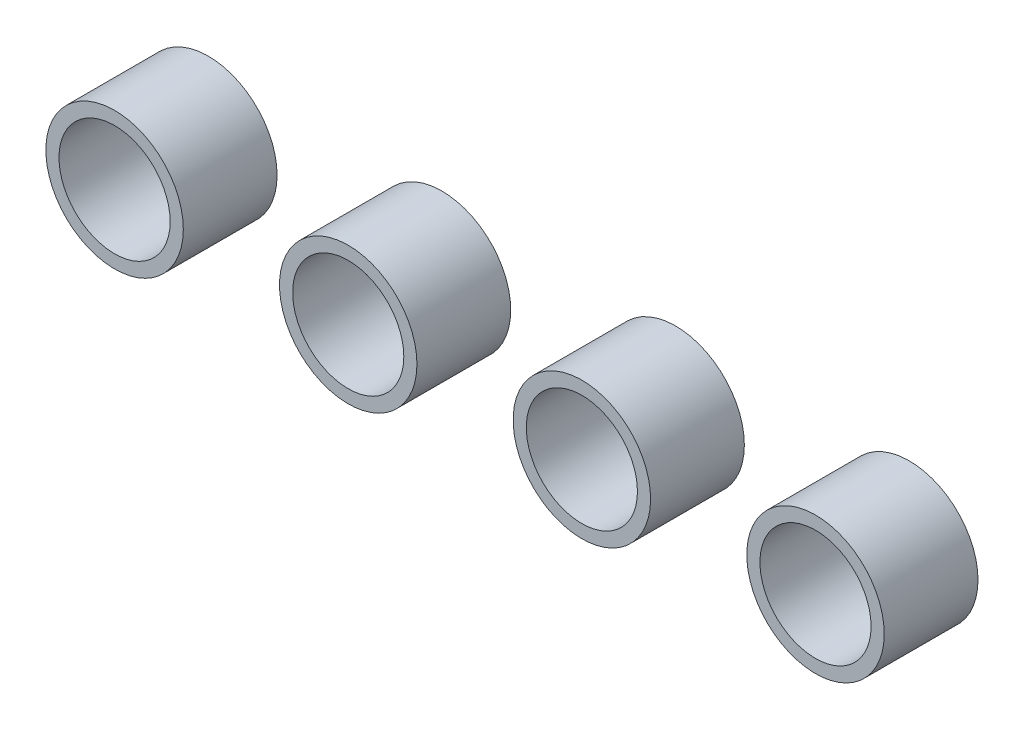
ISO-10303-21;
HEADER;
FILE_DESCRIPTION(('STEP AP214'),'2;1');
FILE_NAME('part.step','',(''),(''),'','','');
FILE_SCHEMA(('AUTOMOTIVE_DESIGN { 1 0 10303 214 1 1 1 1 }'));
ENDSEC;
DATA;
#1=APPLICATION_CONTEXT('core data for automotive mechanical design processes');
#2=APPLICATION_PROTOCOL_DEFINITION('international standard','automotive_design',2000,#1);
#3=PRODUCT_CONTEXT('',#1,'mechanical');
#4=PRODUCT('Part','Part','',(#3));
#5=PRODUCT_RELATED_PRODUCT_CATEGORY('part','',(#4));
#6=PRODUCT_DEFINITION_FORMATION('','',#4);
#7=PRODUCT_DEFINITION_CONTEXT('part definition',#1,'design');
#8=PRODUCT_DEFINITION('design','',#6,#7);
#9=PRODUCT_DEFINITION_SHAPE('','',#8);
#10=(LENGTH_UNIT() NAMED_UNIT(*) SI_UNIT(.MILLI.,.METRE.));
#11=(NAMED_UNIT(*) PLANE_ANGLE_UNIT() SI_UNIT($,.RADIAN.));
#12=(NAMED_UNIT(*) SI_UNIT($,.STERADIAN.) SOLID_ANGLE_UNIT());
#13=UNCERTAINTY_MEASURE_WITH_UNIT(LENGTH_MEASURE(1.E-05),#10,'distance_accuracy_value','');
#14=(GEOMETRIC_REPRESENTATION_CONTEXT(3) GLOBAL_UNCERTAINTY_ASSIGNED_CONTEXT((#13)) GLOBAL_UNIT_ASSIGNED_CONTEXT((#10,
#11,#12)) REPRESENTATION_CONTEXT('',''));
#15=CARTESIAN_POINT('',(0.,0.,0.));
#16=DIRECTION('',(0.,0.,1.));
#17=DIRECTION('',(1.,0.,0.));
#18=AXIS2_PLACEMENT_3D('',#15,#16,#17);
#19=CARTESIAN_POINT('',(220.218,0.,29.464));
#20=DIRECTION('',(0.,0.,1.));
#21=DIRECTION('',(1.,0.,0.));
#22=AXIS2_PLACEMENT_3D('',#19,#20,#21);
#23=PLANE('',#22);
#24=CARTESIAN_POINT('',(220.218,0.,29.464));
#25=DIRECTION('',(0.,0.,1.));
#26=DIRECTION('',(1.,0.,0.));
#27=AXIS2_PLACEMENT_3D('',#24,#25,#26);
#28=CIRCLE('',#27,21.59);
#29=CARTESIAN_POINT('',(241.808,0.,29.464));
#30=VERTEX_POINT('',#29);
#31=EDGE_CURVE('E11',#30,#30,#28,.T.);
#32=ORIENTED_EDGE('',*,*,#31,.T.);
#33=EDGE_LOOP('',(#32));
#34=FACE_BOUND('',#33,.T.);
#35=CARTESIAN_POINT('',(220.218,0.,29.464));
#36=DIRECTION('',(0.,0.,1.));
#37=DIRECTION('',(1.,0.,0.));
#38=AXIS2_PLACEMENT_3D('',#35,#36,#37);
#39=CIRCLE('',#38,17.4625);
#40=CARTESIAN_POINT('',(237.6805,0.,29.464));
#41=VERTEX_POINT('',#40);
#42=EDGE_CURVE('E48',#41,#41,#39,.T.);
#43=ORIENTED_EDGE('',*,*,#42,.F.);
#44=EDGE_LOOP('',(#43));
#45=FACE_BOUND('',#44,.T.);
#46=ADVANCED_FACE('F37',(#34,#45),#23,.T.);
#47=CARTESIAN_POINT('',(220.218,0.,0.));
#48=DIRECTION('',(0.,0.,1.));
#49=DIRECTION('',(1.,0.,0.));
#50=AXIS2_PLACEMENT_3D('',#47,#48,#49);
#51=PLANE('',#50);
#52=CARTESIAN_POINT('',(220.218,0.,0.));
#53=DIRECTION('',(0.,0.,1.));
#54=DIRECTION('',(1.,0.,0.));
#55=AXIS2_PLACEMENT_3D('',#52,#53,#54);
#56=CIRCLE('',#55,21.59);
#57=CARTESIAN_POINT('',(241.808,0.,0.));
#58=VERTEX_POINT('',#57);
#59=EDGE_CURVE('E41',#58,#58,#56,.T.);
#60=ORIENTED_EDGE('',*,*,#59,.F.);
#61=EDGE_LOOP('',(#60));
#62=FACE_BOUND('',#61,.T.);
#63=CARTESIAN_POINT('',(220.218,0.,0.));
#64=DIRECTION('',(0.,0.,1.));
#65=DIRECTION('',(1.,0.,0.));
#66=AXIS2_PLACEMENT_3D('',#63,#64,#65);
#67=CIRCLE('',#66,17.4625);
#68=CARTESIAN_POINT('',(237.6805,0.,0.));
#69=VERTEX_POINT('',#68);
#70=EDGE_CURVE('E50',#69,#69,#67,.T.);
#71=ORIENTED_EDGE('',*,*,#70,.T.);
#72=EDGE_LOOP('',(#71));
#73=FACE_BOUND('',#72,.T.);
#74=ADVANCED_FACE('F60',(#62,#73),#51,.F.);
#75=CARTESIAN_POINT('',(220.218,0.,29.464));
#76=DIRECTION('',(0.,0.,-1.));
#77=DIRECTION('',(-1.,0.,0.));
#78=AXIS2_PLACEMENT_3D('',#75,#76,#77);
#79=CYLINDRICAL_SURFACE('',#78,21.59);
#80=ORIENTED_EDGE('',*,*,#31,.F.);
#81=EDGE_LOOP('',(#80));
#82=FACE_BOUND('',#81,.T.);
#83=ORIENTED_EDGE('',*,*,#59,.T.);
#84=EDGE_LOOP('',(#83));
#85=FACE_BOUND('',#84,.T.);
#86=ADVANCED_FACE('F39',(#82,#85),#79,.T.);
#87=CARTESIAN_POINT('',(220.218,0.,29.464));
#88=DIRECTION('',(0.,0.,-1.));
#89=DIRECTION('',(-1.,0.,0.));
#90=AXIS2_PLACEMENT_3D('',#87,#88,#89);
#91=CYLINDRICAL_SURFACE('',#90,17.4625);
#92=ORIENTED_EDGE('',*,*,#42,.T.);
#93=EDGE_LOOP('',(#92));
#94=FACE_BOUND('',#93,.T.);
#95=ORIENTED_EDGE('',*,*,#70,.F.);
#96=EDGE_LOOP('',(#95));
#97=FACE_BOUND('',#96,.T.);
#98=ADVANCED_FACE('F56',(#94,#97),#91,.F.);
#99=CLOSED_SHELL('',(#46,#74,#86,#98));
#100=MANIFOLD_SOLID_BREP('B2',#99);
#101=CARTESIAN_POINT('',(146.812,0.,29.464));
#102=DIRECTION('',(0.,0.,1.));
#103=DIRECTION('',(1.,0.,0.));
#104=AXIS2_PLACEMENT_3D('',#101,#102,#103);
#105=PLANE('',#104);
#106=CARTESIAN_POINT('',(146.812,0.,29.464));
#107=DIRECTION('',(0.,0.,1.));
#108=DIRECTION('',(1.,0.,0.));
#109=AXIS2_PLACEMENT_3D('',#106,#107,#108);
#110=CIRCLE('',#109,21.59);
#111=CARTESIAN_POINT('',(168.402,0.,29.464));
#112=VERTEX_POINT('',#111);
#113=EDGE_CURVE('E36',#112,#112,#110,.T.);
#114=ORIENTED_EDGE('',*,*,#113,.T.);
#115=EDGE_LOOP('',(#114));
#116=FACE_BOUND('',#115,.T.);
#117=CARTESIAN_POINT('',(146.812,0.,29.464));
#118=DIRECTION('',(0.,0.,1.));
#119=DIRECTION('',(1.,0.,0.));
#120=AXIS2_PLACEMENT_3D('',#117,#118,#119);
#121=CIRCLE('',#120,17.4625);
#122=CARTESIAN_POINT('',(164.2745,0.,29.464));
#123=VERTEX_POINT('',#122);
#124=EDGE_CURVE('E109',#123,#123,#121,.T.);
#125=ORIENTED_EDGE('',*,*,#124,.F.);
#126=EDGE_LOOP('',(#125));
#127=FACE_BOUND('',#126,.T.);
#128=ADVANCED_FACE('F98',(#116,#127),#105,.T.);
#129=CARTESIAN_POINT('',(146.812,0.,0.));
#130=DIRECTION('',(0.,0.,1.));
#131=DIRECTION('',(1.,0.,0.));
#132=AXIS2_PLACEMENT_3D('',#129,#130,#131);
#133=PLANE('',#132);
#134=CARTESIAN_POINT('',(146.812,0.,0.));
#135=DIRECTION('',(0.,0.,1.));
#136=DIRECTION('',(1.,0.,0.));
#137=AXIS2_PLACEMENT_3D('',#134,#135,#136);
#138=CIRCLE('',#137,21.59);
#139=CARTESIAN_POINT('',(168.402,0.,0.));
#140=VERTEX_POINT('',#139);
#141=EDGE_CURVE('E102',#140,#140,#138,.T.);
#142=ORIENTED_EDGE('',*,*,#141,.F.);
#143=EDGE_LOOP('',(#142));
#144=FACE_BOUND('',#143,.T.);
#145=CARTESIAN_POINT('',(146.812,0.,0.));
#146=DIRECTION('',(0.,0.,1.));
#147=DIRECTION('',(1.,0.,0.));
#148=AXIS2_PLACEMENT_3D('',#145,#146,#147);
#149=CIRCLE('',#148,17.4625);
#150=CARTESIAN_POINT('',(164.2745,0.,0.));
#151=VERTEX_POINT('',#150);
#152=EDGE_CURVE('E111',#151,#151,#149,.T.);
#153=ORIENTED_EDGE('',*,*,#152,.T.);
#154=EDGE_LOOP('',(#153));
#155=FACE_BOUND('',#154,.T.);
#156=ADVANCED_FACE('F121',(#144,#155),#133,.F.);
#157=CARTESIAN_POINT('',(146.812,0.,29.464));
#158=DIRECTION('',(0.,0.,-1.));
#159=DIRECTION('',(-1.,0.,0.));
#160=AXIS2_PLACEMENT_3D('',#157,#158,#159);
#161=CYLINDRICAL_SURFACE('',#160,21.59);
#162=ORIENTED_EDGE('',*,*,#113,.F.);
#163=EDGE_LOOP('',(#162));
#164=FACE_BOUND('',#163,.T.);
#165=ORIENTED_EDGE('',*,*,#141,.T.);
#166=EDGE_LOOP('',(#165));
#167=FACE_BOUND('',#166,.T.);
#168=ADVANCED_FACE('F100',(#164,#167),#161,.T.);
#169=CARTESIAN_POINT('',(146.812,0.,29.464));
#170=DIRECTION('',(0.,0.,-1.));
#171=DIRECTION('',(-1.,0.,0.));
#172=AXIS2_PLACEMENT_3D('',#169,#170,#171);
#173=CYLINDRICAL_SURFACE('',#172,17.4625);
#174=ORIENTED_EDGE('',*,*,#124,.T.);
#175=EDGE_LOOP('',(#174));
#176=FACE_BOUND('',#175,.T.);
#177=ORIENTED_EDGE('',*,*,#152,.F.);
#178=EDGE_LOOP('',(#177));
#179=FACE_BOUND('',#178,.T.);
#180=ADVANCED_FACE('F117',(#176,#179),#173,.F.);
#181=CLOSED_SHELL('',(#128,#156,#168,#180));
#182=MANIFOLD_SOLID_BREP('B6',#181);
#183=CARTESIAN_POINT('',(73.406,0.,29.464));
#184=DIRECTION('',(0.,0.,1.));
#185=DIRECTION('',(1.,0.,0.));
#186=AXIS2_PLACEMENT_3D('',#183,#184,#185);
#187=PLANE('',#186);
#188=CARTESIAN_POINT('',(73.406,0.,29.464));
#189=DIRECTION('',(0.,0.,1.));
#190=DIRECTION('',(1.,0.,0.));
#191=AXIS2_PLACEMENT_3D('',#188,#189,#190);
#192=CIRCLE('',#191,21.59);
#193=CARTESIAN_POINT('',(94.996,0.,29.464));
#194=VERTEX_POINT('',#193);
#195=EDGE_CURVE('E97',#194,#194,#192,.T.);
#196=ORIENTED_EDGE('',*,*,#195,.T.);
#197=EDGE_LOOP('',(#196));
#198=FACE_BOUND('',#197,.T.);
#199=CARTESIAN_POINT('',(73.406,0.,29.464));
#200=DIRECTION('',(0.,0.,1.));
#201=DIRECTION('',(1.,0.,0.));
#202=AXIS2_PLACEMENT_3D('',#199,#200,#201);
#203=CIRCLE('',#202,17.4625);
#204=CARTESIAN_POINT('',(90.8685,0.,29.464));
#205=VERTEX_POINT('',#204);
#206=EDGE_CURVE('E169',#205,#205,#203,.T.);
#207=ORIENTED_EDGE('',*,*,#206,.F.);
#208=EDGE_LOOP('',(#207));
#209=FACE_BOUND('',#208,.T.);
#210=ADVANCED_FACE('F158',(#198,#209),#187,.T.);
#211=CARTESIAN_POINT('',(73.406,0.,0.));
#212=DIRECTION('',(0.,0.,1.));
#213=DIRECTION('',(1.,0.,0.));
#214=AXIS2_PLACEMENT_3D('',#211,#212,#213);
#215=PLANE('',#214);
#216=CARTESIAN_POINT('',(73.406,0.,0.));
#217=DIRECTION('',(0.,0.,1.));
#218=DIRECTION('',(1.,0.,0.));
#219=AXIS2_PLACEMENT_3D('',#216,#217,#218);
#220=CIRCLE('',#219,21.59);
#221=CARTESIAN_POINT('',(94.996,0.,0.));
#222=VERTEX_POINT('',#221);
#223=EDGE_CURVE('E162',#222,#222,#220,.T.);
#224=ORIENTED_EDGE('',*,*,#223,.F.);
#225=EDGE_LOOP('',(#224));
#226=FACE_BOUND('',#225,.T.);
#227=CARTESIAN_POINT('',(73.406,0.,0.));
#228=DIRECTION('',(0.,0.,1.));
#229=DIRECTION('',(1.,0.,0.));
#230=AXIS2_PLACEMENT_3D('',#227,#228,#229);
#231=CIRCLE('',#230,17.4625);
#232=CARTESIAN_POINT('',(90.8685,0.,0.));
#233=VERTEX_POINT('',#232);
#234=EDGE_CURVE('E171',#233,#233,#231,.T.);
#235=ORIENTED_EDGE('',*,*,#234,.T.);
#236=EDGE_LOOP('',(#235));
#237=FACE_BOUND('',#236,.T.);
#238=ADVANCED_FACE('F181',(#226,#237),#215,.F.);
#239=CARTESIAN_POINT('',(73.406,0.,29.464));
#240=DIRECTION('',(0.,0.,-1.));
#241=DIRECTION('',(-1.,0.,0.));
#242=AXIS2_PLACEMENT_3D('',#239,#240,#241);
#243=CYLINDRICAL_SURFACE('',#242,21.59);
#244=ORIENTED_EDGE('',*,*,#195,.F.);
#245=EDGE_LOOP('',(#244));
#246=FACE_BOUND('',#245,.T.);
#247=ORIENTED_EDGE('',*,*,#223,.T.);
#248=EDGE_LOOP('',(#247));
#249=FACE_BOUND('',#248,.T.);
#250=ADVANCED_FACE('F160',(#246,#249),#243,.T.);
#251=CARTESIAN_POINT('',(73.406,0.,29.464));
#252=DIRECTION('',(0.,0.,-1.));
#253=DIRECTION('',(-1.,0.,0.));
#254=AXIS2_PLACEMENT_3D('',#251,#252,#253);
#255=CYLINDRICAL_SURFACE('',#254,17.4625);
#256=ORIENTED_EDGE('',*,*,#206,.T.);
#257=EDGE_LOOP('',(#256));
#258=FACE_BOUND('',#257,.T.);
#259=ORIENTED_EDGE('',*,*,#234,.F.);
#260=EDGE_LOOP('',(#259));
#261=FACE_BOUND('',#260,.T.);
#262=ADVANCED_FACE('F177',(#258,#261),#255,.F.);
#263=CLOSED_SHELL('',(#210,#238,#250,#262));
#264=MANIFOLD_SOLID_BREP('B31',#263);
#265=CARTESIAN_POINT('',(0.,0.,29.464));
#266=DIRECTION('',(0.,0.,1.));
#267=DIRECTION('',(1.,0.,0.));
#268=AXIS2_PLACEMENT_3D('',#265,#266,#267);
#269=PLANE('',#268);
#270=CARTESIAN_POINT('',(0.,0.,29.464));
#271=DIRECTION('',(0.,0.,1.));
#272=DIRECTION('',(1.,0.,0.));
#273=AXIS2_PLACEMENT_3D('',#270,#271,#272);
#274=CIRCLE('',#273,21.59);
#275=CARTESIAN_POINT('',(21.59,0.,29.464));
#276=VERTEX_POINT('',#275);
#277=EDGE_CURVE('E157',#276,#276,#274,.T.);
#278=ORIENTED_EDGE('',*,*,#277,.T.);
#279=EDGE_LOOP('',(#278));
#280=FACE_BOUND('',#279,.T.);
#281=CARTESIAN_POINT('',(0.,0.,29.464));
#282=DIRECTION('',(0.,0.,1.));
#283=DIRECTION('',(1.,0.,0.));
#284=AXIS2_PLACEMENT_3D('',#281,#282,#283);
#285=CIRCLE('',#284,17.4625);
#286=CARTESIAN_POINT('',(17.4625,0.,29.464));
#287=VERTEX_POINT('',#286);
#288=EDGE_CURVE('E222',#287,#287,#285,.T.);
#289=ORIENTED_EDGE('',*,*,#288,.F.);
#290=EDGE_LOOP('',(#289));
#291=FACE_BOUND('',#290,.T.);
#292=ADVANCED_FACE('F211',(#280,#291),#269,.T.);
#293=CARTESIAN_POINT('',(0.,0.,0.));
#294=DIRECTION('',(0.,0.,1.));
#295=DIRECTION('',(1.,0.,0.));
#296=AXIS2_PLACEMENT_3D('',#293,#294,#295);
#297=PLANE('',#296);
#298=CARTESIAN_POINT('',(0.,0.,0.));
#299=DIRECTION('',(0.,0.,1.));
#300=DIRECTION('',(1.,0.,0.));
#301=AXIS2_PLACEMENT_3D('',#298,#299,#300);
#302=CIRCLE('',#301,21.59);
#303=CARTESIAN_POINT('',(21.59,0.,0.));
#304=VERTEX_POINT('',#303);
#305=EDGE_CURVE('E215',#304,#304,#302,.T.);
#306=ORIENTED_EDGE('',*,*,#305,.F.);
#307=EDGE_LOOP('',(#306));
#308=FACE_BOUND('',#307,.T.);
#309=CARTESIAN_POINT('',(0.,0.,0.));
#310=DIRECTION('',(0.,0.,1.));
#311=DIRECTION('',(1.,0.,0.));
#312=AXIS2_PLACEMENT_3D('',#309,#310,#311);
#313=CIRCLE('',#312,17.4625);
#314=CARTESIAN_POINT('',(17.4625,0.,0.));
#315=VERTEX_POINT('',#314);
#316=EDGE_CURVE('E224',#315,#315,#313,.T.);
#317=ORIENTED_EDGE('',*,*,#316,.T.);
#318=EDGE_LOOP('',(#317));
#319=FACE_BOUND('',#318,.T.);
#320=ADVANCED_FACE('F234',(#308,#319),#297,.F.);
#321=CARTESIAN_POINT('',(0.,0.,29.464));
#322=DIRECTION('',(0.,0.,-1.));
#323=DIRECTION('',(-1.,0.,0.));
#324=AXIS2_PLACEMENT_3D('',#321,#322,#323);
#325=CYLINDRICAL_SURFACE('',#324,21.59);
#326=ORIENTED_EDGE('',*,*,#277,.F.);
#327=EDGE_LOOP('',(#326));
#328=FACE_BOUND('',#327,.T.);
#329=ORIENTED_EDGE('',*,*,#305,.T.);
#330=EDGE_LOOP('',(#329));
#331=FACE_BOUND('',#330,.T.);
#332=ADVANCED_FACE('F213',(#328,#331),#325,.T.);
#333=CARTESIAN_POINT('',(0.,0.,29.464));
#334=DIRECTION('',(0.,0.,-1.));
#335=DIRECTION('',(-1.,0.,0.));
#336=AXIS2_PLACEMENT_3D('',#333,#334,#335);
#337=CYLINDRICAL_SURFACE('',#336,17.4625);
#338=ORIENTED_EDGE('',*,*,#288,.T.);
#339=EDGE_LOOP('',(#338));
#340=FACE_BOUND('',#339,.T.);
#341=ORIENTED_EDGE('',*,*,#316,.F.);
#342=EDGE_LOOP('',(#341));
#343=FACE_BOUND('',#342,.T.);
#344=ADVANCED_FACE('F230',(#340,#343),#337,.F.);
#345=CLOSED_SHELL('',(#292,#320,#332,#344));
#346=MANIFOLD_SOLID_BREP('B92',#345);
#347=ADVANCED_BREP_SHAPE_REPRESENTATION('',(#18,#100,#182,#264,#346),#14);
#348=SHAPE_DEFINITION_REPRESENTATION(#9,#347);
ENDSEC;
END-ISO-10303-21;
